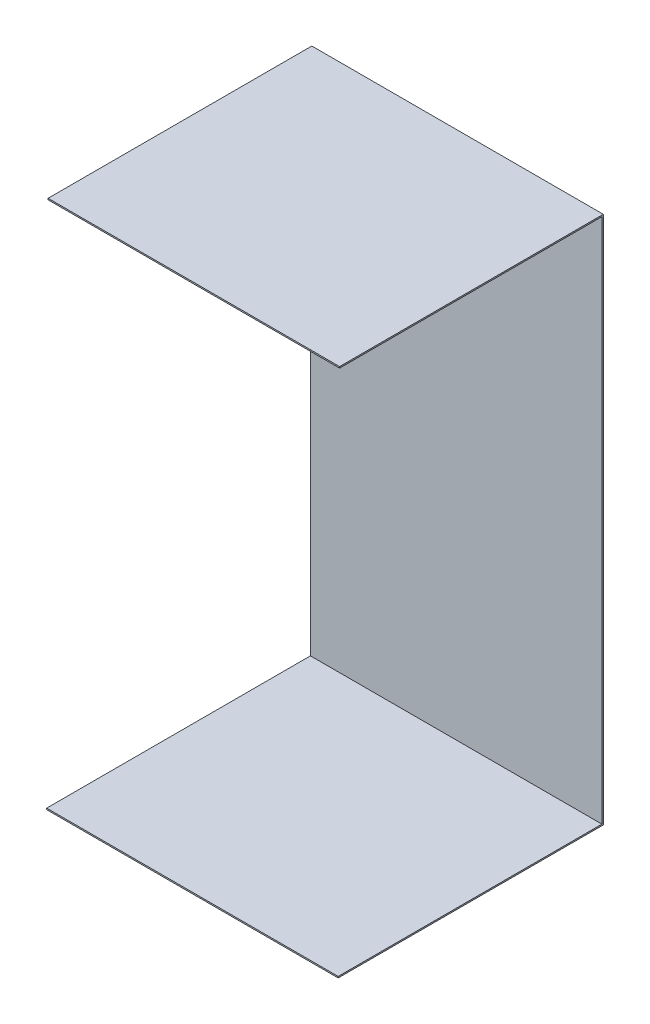
ISO-10303-21;
HEADER;
FILE_DESCRIPTION(('STEP AP214'),'2;1');
FILE_NAME('part.step','',(''),(''),'','','');
FILE_SCHEMA(('AUTOMOTIVE_DESIGN { 1 0 10303 214 1 1 1 1 }'));
ENDSEC;
DATA;
#1=APPLICATION_CONTEXT('core data for automotive mechanical design processes');
#2=APPLICATION_PROTOCOL_DEFINITION('international standard','automotive_design',2000,#1);
#3=PRODUCT_CONTEXT('',#1,'mechanical');
#4=PRODUCT('Part','Part','',(#3));
#5=PRODUCT_RELATED_PRODUCT_CATEGORY('part','',(#4));
#6=PRODUCT_DEFINITION_FORMATION('','',#4);
#7=PRODUCT_DEFINITION_CONTEXT('part definition',#1,'design');
#8=PRODUCT_DEFINITION('design','',#6,#7);
#9=PRODUCT_DEFINITION_SHAPE('','',#8);
#10=(LENGTH_UNIT() NAMED_UNIT(*) SI_UNIT(.MILLI.,.METRE.));
#11=(NAMED_UNIT(*) PLANE_ANGLE_UNIT() SI_UNIT($,.RADIAN.));
#12=(NAMED_UNIT(*) SI_UNIT($,.STERADIAN.) SOLID_ANGLE_UNIT());
#13=UNCERTAINTY_MEASURE_WITH_UNIT(LENGTH_MEASURE(1.E-05),#10,'distance_accuracy_value','');
#14=(GEOMETRIC_REPRESENTATION_CONTEXT(3) GLOBAL_UNCERTAINTY_ASSIGNED_CONTEXT((#13)) GLOBAL_UNIT_ASSIGNED_CONTEXT((#10,
#11,#12)) REPRESENTATION_CONTEXT('',''));
#15=CARTESIAN_POINT('',(0.,0.,0.));
#16=DIRECTION('',(0.,0.,1.));
#17=DIRECTION('',(1.,0.,0.));
#18=AXIS2_PLACEMENT_3D('',#15,#16,#17);
#19=CARTESIAN_POINT('',(0.,0.,2.));
#20=DIRECTION('',(1.,0.,0.));
#21=DIRECTION('',(0.,0.,-1.));
#22=AXIS2_PLACEMENT_3D('',#19,#20,#21);
#23=PLANE('',#22);
#24=DIRECTION('',(0.,-1.,0.));
#25=VECTOR('',#24,1.);
#26=CARTESIAN_POINT('',(0.,0.,0.));
#27=LINE('',#26,#25);
#28=CARTESIAN_POINT('',(0.,762.,0.));
#29=VERTEX_POINT('',#28);
#30=CARTESIAN_POINT('',(0.,0.,0.));
#31=VERTEX_POINT('',#30);
#32=EDGE_CURVE('E78',#29,#31,#27,.T.);
#33=ORIENTED_EDGE('',*,*,#32,.T.);
#34=DIRECTION('',(0.,0.,-1.));
#35=VECTOR('',#34,1.);
#36=CARTESIAN_POINT('',(0.,0.,2.));
#37=LINE('',#36,#35);
#38=CARTESIAN_POINT('',(0.,0.,382.));
#39=VERTEX_POINT('',#38);
#40=EDGE_CURVE('E11',#39,#31,#37,.T.);
#41=ORIENTED_EDGE('',*,*,#40,.F.);
#42=DIRECTION('',(0.,-1.,0.));
#43=VECTOR('',#42,1.);
#44=CARTESIAN_POINT('',(0.,0.,382.));
#45=LINE('',#44,#43);
#46=CARTESIAN_POINT('',(0.,2.,382.));
#47=VERTEX_POINT('',#46);
#48=EDGE_CURVE('E129',#47,#39,#45,.T.);
#49=ORIENTED_EDGE('',*,*,#48,.F.);
#50=DIRECTION('',(0.,0.,1.));
#51=VECTOR('',#50,1.);
#52=CARTESIAN_POINT('',(0.,2.,0.));
#53=LINE('',#52,#51);
#54=CARTESIAN_POINT('',(0.,2.,2.));
#55=VERTEX_POINT('',#54);
#56=EDGE_CURVE('E121',#55,#47,#53,.T.);
#57=ORIENTED_EDGE('',*,*,#56,.F.);
#58=DIRECTION('',(0.,-1.,0.));
#59=VECTOR('',#58,1.);
#60=CARTESIAN_POINT('',(0.,0.,2.));
#61=LINE('',#60,#59);
#62=CARTESIAN_POINT('',(0.,760.,2.));
#63=VERTEX_POINT('',#62);
#64=EDGE_CURVE('E57',#63,#55,#61,.T.);
#65=ORIENTED_EDGE('',*,*,#64,.F.);
#66=DIRECTION('',(0.,0.,1.));
#67=VECTOR('',#66,1.);
#68=CARTESIAN_POINT('',(0.,760.,0.));
#69=LINE('',#68,#67);
#70=CARTESIAN_POINT('',(0.,760.,380.));
#71=VERTEX_POINT('',#70);
#72=EDGE_CURVE('E66',#63,#71,#69,.T.);
#73=ORIENTED_EDGE('',*,*,#72,.T.);
#74=DIRECTION('',(0.,1.,0.));
#75=VECTOR('',#74,1.);
#76=CARTESIAN_POINT('',(0.,760.,380.));
#77=LINE('',#76,#75);
#78=CARTESIAN_POINT('',(0.,762.,380.));
#79=VERTEX_POINT('',#78);
#80=EDGE_CURVE('E150',#71,#79,#77,.T.);
#81=ORIENTED_EDGE('',*,*,#80,.T.);
#82=DIRECTION('',(0.,0.,-1.));
#83=VECTOR('',#82,1.);
#84=CARTESIAN_POINT('',(0.,762.,0.));
#85=LINE('',#84,#83);
#86=EDGE_CURVE('E178',#79,#29,#85,.T.);
#87=ORIENTED_EDGE('',*,*,#86,.T.);
#88=EDGE_LOOP('',(#33,#41,#49,#57,#65,#73,#81,#87));
#89=FACE_BOUND('',#88,.T.);
#90=ADVANCED_FACE('F41',(#89),#23,.F.);
#91=CARTESIAN_POINT('',(0.,0.,2.));
#92=DIRECTION('',(0.,1.,0.));
#93=DIRECTION('',(0.,0.,1.));
#94=AXIS2_PLACEMENT_3D('',#91,#92,#93);
#95=PLANE('',#94);
#96=DIRECTION('',(1.,0.,0.));
#97=VECTOR('',#96,1.);
#98=CARTESIAN_POINT('',(0.,0.,0.));
#99=LINE('',#98,#97);
#100=CARTESIAN_POINT('',(420.,0.,0.));
#101=VERTEX_POINT('',#100);
#102=EDGE_CURVE('E168',#31,#101,#99,.T.);
#103=ORIENTED_EDGE('',*,*,#102,.T.);
#104=DIRECTION('',(0.,0.,-1.));
#105=VECTOR('',#104,1.);
#106=CARTESIAN_POINT('',(420.,0.,2.));
#107=LINE('',#106,#105);
#108=CARTESIAN_POINT('',(420.,0.,382.));
#109=VERTEX_POINT('',#108);
#110=EDGE_CURVE('E49',#109,#101,#107,.T.);
#111=ORIENTED_EDGE('',*,*,#110,.F.);
#112=DIRECTION('',(1.,0.,0.));
#113=VECTOR('',#112,1.);
#114=CARTESIAN_POINT('',(0.,0.,382.));
#115=LINE('',#114,#113);
#116=EDGE_CURVE('E137',#39,#109,#115,.T.);
#117=ORIENTED_EDGE('',*,*,#116,.F.);
#118=ORIENTED_EDGE('',*,*,#40,.T.);
#119=EDGE_LOOP('',(#103,#111,#117,#118));
#120=FACE_BOUND('',#119,.T.);
#121=ADVANCED_FACE('F203',(#120),#95,.F.);
#122=CARTESIAN_POINT('',(420.,0.,2.));
#123=DIRECTION('',(-1.,0.,0.));
#124=DIRECTION('',(0.,0.,1.));
#125=AXIS2_PLACEMENT_3D('',#122,#123,#124);
#126=PLANE('',#125);
#127=DIRECTION('',(0.,1.,0.));
#128=VECTOR('',#127,1.);
#129=CARTESIAN_POINT('',(420.,0.,2.));
#130=LINE('',#129,#128);
#131=CARTESIAN_POINT('',(420.,2.,2.));
#132=VERTEX_POINT('',#131);
#133=CARTESIAN_POINT('',(420.,760.,2.));
#134=VERTEX_POINT('',#133);
#135=EDGE_CURVE('E44',#132,#134,#130,.T.);
#136=ORIENTED_EDGE('',*,*,#135,.F.);
#137=DIRECTION('',(0.,0.,1.));
#138=VECTOR('',#137,1.);
#139=CARTESIAN_POINT('',(420.,2.,0.));
#140=LINE('',#139,#138);
#141=CARTESIAN_POINT('',(420.,2.,382.));
#142=VERTEX_POINT('',#141);
#143=EDGE_CURVE('E142',#132,#142,#140,.T.);
#144=ORIENTED_EDGE('',*,*,#143,.T.);
#145=DIRECTION('',(0.,-1.,0.));
#146=VECTOR('',#145,1.);
#147=CARTESIAN_POINT('',(420.,0.,382.));
#148=LINE('',#147,#146);
#149=EDGE_CURVE('E130',#142,#109,#148,.T.);
#150=ORIENTED_EDGE('',*,*,#149,.T.);
#151=ORIENTED_EDGE('',*,*,#110,.T.);
#152=DIRECTION('',(0.,1.,0.));
#153=VECTOR('',#152,1.);
#154=CARTESIAN_POINT('',(420.,0.,0.));
#155=LINE('',#154,#153);
#156=CARTESIAN_POINT('',(420.,762.,0.));
#157=VERTEX_POINT('',#156);
#158=EDGE_CURVE('E104',#101,#157,#155,.T.);
#159=ORIENTED_EDGE('',*,*,#158,.T.);
#160=DIRECTION('',(0.,0.,-1.));
#161=VECTOR('',#160,1.);
#162=CARTESIAN_POINT('',(420.,762.,0.));
#163=LINE('',#162,#161);
#164=CARTESIAN_POINT('',(420.,762.,380.));
#165=VERTEX_POINT('',#164);
#166=EDGE_CURVE('E155',#165,#157,#163,.T.);
#167=ORIENTED_EDGE('',*,*,#166,.F.);
#168=DIRECTION('',(0.,1.,0.));
#169=VECTOR('',#168,1.);
#170=CARTESIAN_POINT('',(420.,760.,380.));
#171=LINE('',#170,#169);
#172=CARTESIAN_POINT('',(420.,760.,380.));
#173=VERTEX_POINT('',#172);
#174=EDGE_CURVE('E191',#173,#165,#171,.T.);
#175=ORIENTED_EDGE('',*,*,#174,.F.);
#176=DIRECTION('',(0.,0.,1.));
#177=VECTOR('',#176,1.);
#178=CARTESIAN_POINT('',(420.,760.,0.));
#179=LINE('',#178,#177);
#180=EDGE_CURVE('E147',#134,#173,#179,.T.);
#181=ORIENTED_EDGE('',*,*,#180,.F.);
#182=EDGE_LOOP('',(#136,#144,#150,#151,#159,#167,#175,#181));
#183=FACE_BOUND('',#182,.T.);
#184=ADVANCED_FACE('F170',(#183),#126,.F.);
#185=CARTESIAN_POINT('',(0.,0.,2.));
#186=DIRECTION('',(0.,0.,-1.));
#187=DIRECTION('',(-1.,0.,0.));
#188=AXIS2_PLACEMENT_3D('',#185,#186,#187);
#189=PLANE('',#188);
#190=ORIENTED_EDGE('',*,*,#64,.T.);
#191=DIRECTION('',(1.,0.,0.));
#192=VECTOR('',#191,1.);
#193=CARTESIAN_POINT('',(0.,2.,2.));
#194=LINE('',#193,#192);
#195=EDGE_CURVE('E127',#55,#132,#194,.T.);
#196=ORIENTED_EDGE('',*,*,#195,.T.);
#197=ORIENTED_EDGE('',*,*,#135,.T.);
#198=DIRECTION('',(-1.,0.,0.));
#199=VECTOR('',#198,1.);
#200=CARTESIAN_POINT('',(0.,760.,2.));
#201=LINE('',#200,#199);
#202=EDGE_CURVE('E162',#134,#63,#201,.T.);
#203=ORIENTED_EDGE('',*,*,#202,.T.);
#204=EDGE_LOOP('',(#190,#196,#197,#203));
#205=FACE_BOUND('',#204,.T.);
#206=ADVANCED_FACE('F195',(#205),#189,.F.);
#207=CARTESIAN_POINT('',(0.,0.,0.));
#208=DIRECTION('',(0.,0.,-1.));
#209=DIRECTION('',(-1.,0.,0.));
#210=AXIS2_PLACEMENT_3D('',#207,#208,#209);
#211=PLANE('',#210);
#212=DIRECTION('',(1.,0.,0.));
#213=VECTOR('',#212,1.);
#214=CARTESIAN_POINT('',(0.,762.,0.));
#215=LINE('',#214,#213);
#216=EDGE_CURVE('E174',#29,#157,#215,.T.);
#217=ORIENTED_EDGE('',*,*,#216,.T.);
#218=ORIENTED_EDGE('',*,*,#158,.F.);
#219=ORIENTED_EDGE('',*,*,#102,.F.);
#220=ORIENTED_EDGE('',*,*,#32,.F.);
#221=EDGE_LOOP('',(#217,#218,#219,#220));
#222=FACE_BOUND('',#221,.T.);
#223=ADVANCED_FACE('F172',(#222),#211,.T.);
#224=CARTESIAN_POINT('',(0.,760.,0.));
#225=DIRECTION('',(0.,1.,0.));
#226=DIRECTION('',(0.,0.,1.));
#227=AXIS2_PLACEMENT_3D('',#224,#225,#226);
#228=PLANE('',#227);
#229=ORIENTED_EDGE('',*,*,#202,.F.);
#230=ORIENTED_EDGE('',*,*,#180,.T.);
#231=DIRECTION('',(1.,0.,0.));
#232=VECTOR('',#231,1.);
#233=CARTESIAN_POINT('',(0.,760.,380.));
#234=LINE('',#233,#232);
#235=EDGE_CURVE('E181',#71,#173,#234,.T.);
#236=ORIENTED_EDGE('',*,*,#235,.F.);
#237=ORIENTED_EDGE('',*,*,#72,.F.);
#238=EDGE_LOOP('',(#229,#230,#236,#237));
#239=FACE_BOUND('',#238,.T.);
#240=ADVANCED_FACE('F194',(#239),#228,.F.);
#241=CARTESIAN_POINT('',(0.,760.,380.));
#242=DIRECTION('',(0.,0.,-1.));
#243=DIRECTION('',(-1.,0.,0.));
#244=AXIS2_PLACEMENT_3D('',#241,#242,#243);
#245=PLANE('',#244);
#246=ORIENTED_EDGE('',*,*,#174,.T.);
#247=DIRECTION('',(1.,0.,0.));
#248=VECTOR('',#247,1.);
#249=CARTESIAN_POINT('',(0.,762.,380.));
#250=LINE('',#249,#248);
#251=EDGE_CURVE('E177',#79,#165,#250,.T.);
#252=ORIENTED_EDGE('',*,*,#251,.F.);
#253=ORIENTED_EDGE('',*,*,#80,.F.);
#254=ORIENTED_EDGE('',*,*,#235,.T.);
#255=EDGE_LOOP('',(#246,#252,#253,#254));
#256=FACE_BOUND('',#255,.T.);
#257=ADVANCED_FACE('F189',(#256),#245,.F.);
#258=CARTESIAN_POINT('',(0.,762.,0.));
#259=DIRECTION('',(0.,-1.,0.));
#260=DIRECTION('',(0.,0.,-1.));
#261=AXIS2_PLACEMENT_3D('',#258,#259,#260);
#262=PLANE('',#261);
#263=ORIENTED_EDGE('',*,*,#166,.T.);
#264=ORIENTED_EDGE('',*,*,#216,.F.);
#265=ORIENTED_EDGE('',*,*,#86,.F.);
#266=ORIENTED_EDGE('',*,*,#251,.T.);
#267=EDGE_LOOP('',(#263,#264,#265,#266));
#268=FACE_BOUND('',#267,.T.);
#269=ADVANCED_FACE('F237',(#268),#262,.F.);
#270=CARTESIAN_POINT('',(0.,2.,0.));
#271=DIRECTION('',(0.,1.,0.));
#272=DIRECTION('',(0.,0.,1.));
#273=AXIS2_PLACEMENT_3D('',#270,#271,#272);
#274=PLANE('',#273);
#275=ORIENTED_EDGE('',*,*,#195,.F.);
#276=ORIENTED_EDGE('',*,*,#56,.T.);
#277=DIRECTION('',(1.,0.,0.));
#278=VECTOR('',#277,1.);
#279=CARTESIAN_POINT('',(0.,2.,382.));
#280=LINE('',#279,#278);
#281=EDGE_CURVE('E125',#47,#142,#280,.T.);
#282=ORIENTED_EDGE('',*,*,#281,.T.);
#283=ORIENTED_EDGE('',*,*,#143,.F.);
#284=EDGE_LOOP('',(#275,#276,#282,#283));
#285=FACE_BOUND('',#284,.T.);
#286=ADVANCED_FACE('F123',(#285),#274,.T.);
#287=CARTESIAN_POINT('',(0.,0.,382.));
#288=DIRECTION('',(0.,0.,1.));
#289=DIRECTION('',(1.,0.,0.));
#290=AXIS2_PLACEMENT_3D('',#287,#288,#289);
#291=PLANE('',#290);
#292=ORIENTED_EDGE('',*,*,#149,.F.);
#293=ORIENTED_EDGE('',*,*,#281,.F.);
#294=ORIENTED_EDGE('',*,*,#48,.T.);
#295=ORIENTED_EDGE('',*,*,#116,.T.);
#296=EDGE_LOOP('',(#292,#293,#294,#295));
#297=FACE_BOUND('',#296,.T.);
#298=ADVANCED_FACE('F134',(#297),#291,.T.);
#299=CLOSED_SHELL('',(#90,#121,#184,#206,#223,#240,#257,#269,#286,#298));
#300=MANIFOLD_SOLID_BREP('B2',#299);
#301=ADVANCED_BREP_SHAPE_REPRESENTATION('',(#18,#300),#14);
#302=SHAPE_DEFINITION_REPRESENTATION(#9,#301);
ENDSEC;
END-ISO-10303-21;
